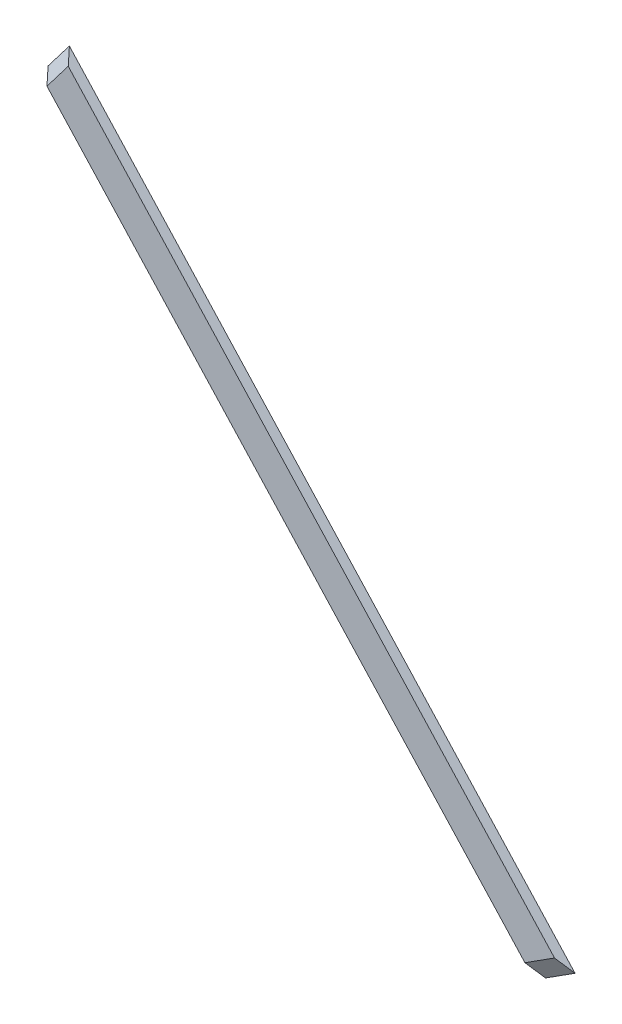
ISO-10303-21;
HEADER;
FILE_DESCRIPTION(('STEP AP214'),'2;1');
FILE_NAME('part.step','',(''),(''),'','','');
FILE_SCHEMA(('AUTOMOTIVE_DESIGN { 1 0 10303 214 1 1 1 1 }'));
ENDSEC;
DATA;
#1=APPLICATION_CONTEXT('core data for automotive mechanical design processes');
#2=APPLICATION_PROTOCOL_DEFINITION('international standard','automotive_design',2000,#1);
#3=PRODUCT_CONTEXT('',#1,'mechanical');
#4=PRODUCT('Part','Part','',(#3));
#5=PRODUCT_RELATED_PRODUCT_CATEGORY('part','',(#4));
#6=PRODUCT_DEFINITION_FORMATION('','',#4);
#7=PRODUCT_DEFINITION_CONTEXT('part definition',#1,'design');
#8=PRODUCT_DEFINITION('design','',#6,#7);
#9=PRODUCT_DEFINITION_SHAPE('','',#8);
#10=(LENGTH_UNIT() NAMED_UNIT(*) SI_UNIT(.MILLI.,.METRE.));
#11=(NAMED_UNIT(*) PLANE_ANGLE_UNIT() SI_UNIT($,.RADIAN.));
#12=(NAMED_UNIT(*) SI_UNIT($,.STERADIAN.) SOLID_ANGLE_UNIT());
#13=UNCERTAINTY_MEASURE_WITH_UNIT(LENGTH_MEASURE(1.E-05),#10,'distance_accuracy_value','');
#14=(GEOMETRIC_REPRESENTATION_CONTEXT(3) GLOBAL_UNCERTAINTY_ASSIGNED_CONTEXT((#13)) GLOBAL_UNIT_ASSIGNED_CONTEXT((#10,
#11,#12)) REPRESENTATION_CONTEXT('',''));
#15=CARTESIAN_POINT('',(0.,0.,0.));
#16=DIRECTION('',(0.,0.,1.));
#17=DIRECTION('',(1.,0.,0.));
#18=AXIS2_PLACEMENT_3D('',#15,#16,#17);
#19=CARTESIAN_POINT('',(0.,0.,24.8019022697676));
#20=DIRECTION('',(0.,0.,1.));
#21=DIRECTION('',(1.,0.,0.));
#22=AXIS2_PLACEMENT_3D('',#19,#20,#21);
#23=PLANE('',#22);
#24=DIRECTION('',(0.607061998206699,0.794654472291756,0.));
#25=VECTOR('',#24,1.);
#26=CARTESIAN_POINT('',(3755.84401917912,4860.23069457391,24.8019022697676));
#27=LINE('',#26,#25);
#28=CARTESIAN_POINT('',(3755.84401917912,4860.23069457391,24.8019022697676));
#29=VERTEX_POINT('',#28);
#30=CARTESIAN_POINT('',(3817.9864154112,4941.5761473129,24.8019022697677));
#31=VERTEX_POINT('',#30);
#32=EDGE_CURVE('E54',#29,#31,#27,.T.);
#33=ORIENTED_EDGE('',*,*,#32,.F.);
#34=DIRECTION('',(-0.676673678812601,0.736283051823292,0.));
#35=VECTOR('',#34,1.);
#36=CARTESIAN_POINT('',(4457.57133717751,4096.68698447975,24.8019022697676));
#37=LINE('',#36,#35);
#38=CARTESIAN_POINT('',(5150.38212534958,3342.84527698709,24.8019022697674));
#39=VERTEX_POINT('',#38);
#40=EDGE_CURVE('E73',#29,#39,#37,.F.);
#41=ORIENTED_EDGE('',*,*,#40,.T.);
#42=DIRECTION('',(-0.84296092351779,-0.537974796270266,0.));
#43=VECTOR('',#42,1.);
#44=CARTESIAN_POINT('',(5236.67250734048,3397.91550548346,24.801902269767));
#45=LINE('',#44,#43);
#46=CARTESIAN_POINT('',(5236.67250734048,3397.91550548346,24.8019022697675));
#47=VERTEX_POINT('',#46);
#48=EDGE_CURVE('E65',#47,#39,#45,.T.);
#49=ORIENTED_EDGE('',*,*,#48,.F.);
#50=DIRECTION('',(0.676673678812601,-0.736283051823292,0.));
#51=VECTOR('',#50,1.);
#52=CARTESIAN_POINT('',(4531.78772628901,4164.89482509743,24.8019022697678));
#53=LINE('',#52,#51);
#54=EDGE_CURVE('E19',#47,#31,#53,.F.);
#55=ORIENTED_EDGE('',*,*,#54,.T.);
#56=EDGE_LOOP('',(#33,#41,#49,#55));
#57=FACE_BOUND('',#56,.T.);
#58=ADVANCED_FACE('F16',(#57),#23,.T.);
#59=CARTESIAN_POINT('',(4462.52945292275,4101.24369186693,767.562971489655));
#60=DIRECTION('',(-0.730448811768304,-0.671311778017372,-0.125638489649577));
#61=DIRECTION('',(0.676673678812601,-0.736283051823292,0.));
#62=AXIS2_PLACEMENT_3D('',#59,#60,#61);
#63=PLANE('',#62);
#64=DIRECTION('',(-0.676673678812593,0.7362830518233,0.));
#65=VECTOR('',#64,1.);
#66=CARTESIAN_POINT('',(5271.73656708554,3364.40435914039,0.));
#67=LINE('',#66,#65);
#68=CARTESIAN_POINT('',(5271.73656708555,3364.4043591404,-1.24939692007304E-11));
#69=VERTEX_POINT('',#68);
#70=CARTESIAN_POINT('',(3796.46416002181,4969.63610400396,-8.34185151510347E-12));
#71=VERTEX_POINT('',#70);
#72=EDGE_CURVE('E71',#69,#71,#67,.T.);
#73=ORIENTED_EDGE('',*,*,#72,.T.);
#74=DIRECTION('',(-0.498272048507427,0.649629504367767,-0.574200725122411));
#75=VECTOR('',#74,1.);
#76=CARTESIAN_POINT('',(3817.9864154112,4941.5761473129,24.8019022697681));
#77=LINE('',#76,#75);
#78=EDGE_CURVE('E61',#31,#71,#77,.T.);
#79=ORIENTED_EDGE('',*,*,#78,.F.);
#80=ORIENTED_EDGE('',*,*,#54,.F.);
#81=DIRECTION('',(-0.643662317162457,0.61515586793922,0.455282417412535));
#82=VECTOR('',#81,1.);
#83=CARTESIAN_POINT('',(5271.73656708553,3364.40435914041,-4.55191440096314E-11));
#84=LINE('',#83,#82);
#85=EDGE_CURVE('E77',#69,#47,#84,.T.);
#86=ORIENTED_EDGE('',*,*,#85,.F.);
#87=EDGE_LOOP('',(#73,#79,#80,#86));
#88=FACE_BOUND('',#87,.T.);
#89=ADVANCED_FACE('F70',(#88),#63,.F.);
#90=CARTESIAN_POINT('',(0.,0.,0.));
#91=DIRECTION('',(-0.467086179481356,0.356822089773095,0.809016994374946));
#92=DIRECTION('',(0.866025403784439,0.,0.5));
#93=AXIS2_PLACEMENT_3D('',#90,#91,#92);
#94=PLANE('',#93);
#95=DIRECTION('',(-0.607061998206594,-0.794654472291837,0.));
#96=VECTOR('',#95,1.);
#97=CARTESIAN_POINT('',(3796.46416002181,4969.63610400396,0.));
#98=LINE('',#97,#96);
#99=CARTESIAN_POINT('',(3734.32176378973,4888.29065126496,-1.1538801595028E-11));
#100=VERTEX_POINT('',#99);
#101=EDGE_CURVE('E82',#71,#100,#98,.T.);
#102=ORIENTED_EDGE('',*,*,#101,.T.);
#103=DIRECTION('',(0.498272048507726,-0.649629504368005,0.574200725121881));
#104=VECTOR('',#103,1.);
#105=CARTESIAN_POINT('',(3734.32176378972,4888.29065126497,-1.11022302462516E-13));
#106=LINE('',#105,#104);
#107=EDGE_CURVE('E63',#100,#29,#106,.T.);
#108=ORIENTED_EDGE('',*,*,#107,.T.);
#109=ORIENTED_EDGE('',*,*,#32,.T.);
#110=ORIENTED_EDGE('',*,*,#78,.T.);
#111=EDGE_LOOP('',(#102,#108,#109,#110));
#112=FACE_BOUND('',#111,.T.);
#113=ADVANCED_FACE('F59',(#112),#94,.T.);
#114=CARTESIAN_POINT('',(4389.48457174591,4034.1125140652,754.999122524695));
#115=DIRECTION('',(0.730448811768304,0.671311778017372,0.125638489649577));
#116=DIRECTION('',(-0.676673678812601,0.736283051823292,0.));
#117=AXIS2_PLACEMENT_3D('',#114,#115,#116);
#118=PLANE('',#117);
#119=ORIENTED_EDGE('',*,*,#40,.F.);
#120=ORIENTED_EDGE('',*,*,#107,.F.);
#121=DIRECTION('',(0.676673678812601,-0.736283051823292,0.));
#122=VECTOR('',#121,1.);
#123=CARTESIAN_POINT('',(3734.32176378973,4888.29065126497,0.));
#124=LINE('',#123,#122);
#125=CARTESIAN_POINT('',(5185.44618509466,3309.33413064404,-1.09265894943089E-11));
#126=VERTEX_POINT('',#125);
#127=EDGE_CURVE('E25',#100,#126,#124,.T.);
#128=ORIENTED_EDGE('',*,*,#127,.T.);
#129=DIRECTION('',(0.643662317162779,-0.615155867938914,-0.455282417412494));
#130=VECTOR('',#129,1.);
#131=CARTESIAN_POINT('',(5150.38212534958,3342.84527698709,24.8019022697672));
#132=LINE('',#131,#130);
#133=EDGE_CURVE('E33',#39,#126,#132,.T.);
#134=ORIENTED_EDGE('',*,*,#133,.F.);
#135=EDGE_LOOP('',(#119,#120,#128,#134));
#136=FACE_BOUND('',#135,.T.);
#137=ADVANCED_FACE('F87',(#136),#118,.F.);
#138=CARTESIAN_POINT('',(0.,0.,0.));
#139=DIRECTION('',(0.250607512160671,-0.392680737752119,0.884871579974796));
#140=DIRECTION('',(0.,-0.914039707413188,-0.405624719749689));
#141=AXIS2_PLACEMENT_3D('',#138,#139,#140);
#142=PLANE('',#141);
#143=ORIENTED_EDGE('',*,*,#48,.T.);
#144=ORIENTED_EDGE('',*,*,#133,.T.);
#145=DIRECTION('',(0.842960923517821,0.537974796270217,0.));
#146=VECTOR('',#145,1.);
#147=CARTESIAN_POINT('',(5185.44618509466,3309.33413064404,0.));
#148=LINE('',#147,#146);
#149=EDGE_CURVE('E11',#126,#69,#148,.T.);
#150=ORIENTED_EDGE('',*,*,#149,.T.);
#151=ORIENTED_EDGE('',*,*,#85,.T.);
#152=EDGE_LOOP('',(#143,#144,#150,#151));
#153=FACE_BOUND('',#152,.T.);
#154=ADVANCED_FACE('F90',(#153),#142,.T.);
#155=CARTESIAN_POINT('',(0.,0.,0.));
#156=DIRECTION('',(0.,0.,1.));
#157=DIRECTION('',(1.,0.,0.));
#158=AXIS2_PLACEMENT_3D('',#155,#156,#157);
#159=PLANE('',#158);
#160=ORIENTED_EDGE('',*,*,#127,.F.);
#161=ORIENTED_EDGE('',*,*,#101,.F.);
#162=ORIENTED_EDGE('',*,*,#72,.F.);
#163=ORIENTED_EDGE('',*,*,#149,.F.);
#164=EDGE_LOOP('',(#160,#161,#162,#163));
#165=FACE_BOUND('',#164,.T.);
#166=ADVANCED_FACE('F89',(#165),#159,.F.);
#167=CLOSED_SHELL('',(#58,#89,#113,#137,#154,#166));
#168=MANIFOLD_SOLID_BREP('B1',#167);
#169=ADVANCED_BREP_SHAPE_REPRESENTATION('',(#18,#168),#14);
#170=SHAPE_DEFINITION_REPRESENTATION(#9,#169);
ENDSEC;
END-ISO-10303-21;
